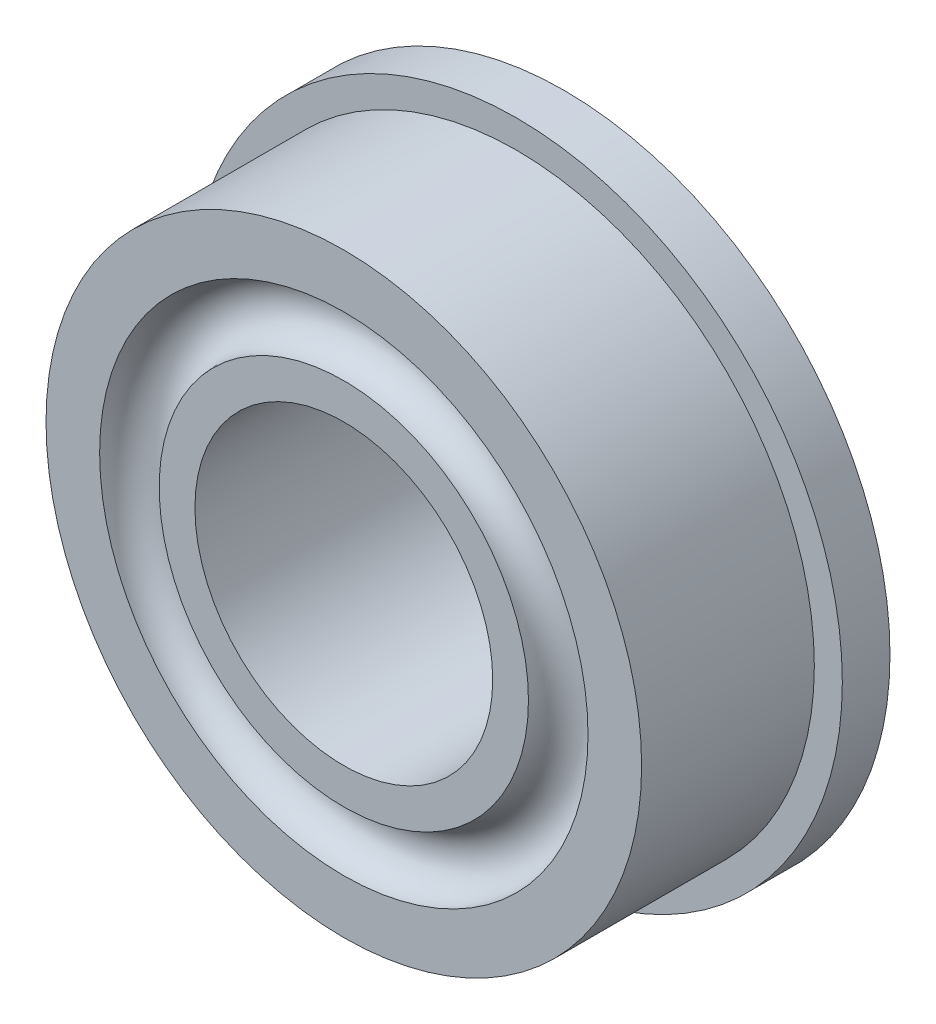
ISO-10303-21;
HEADER;
FILE_DESCRIPTION(('STEP AP214'),'2;1');
FILE_NAME('part.step','',(''),(''),'','','');
FILE_SCHEMA(('AUTOMOTIVE_DESIGN { 1 0 10303 214 1 1 1 1 }'));
ENDSEC;
DATA;
#1=APPLICATION_CONTEXT('core data for automotive mechanical design processes');
#2=APPLICATION_PROTOCOL_DEFINITION('international standard','automotive_design',2000,#1);
#3=PRODUCT_CONTEXT('',#1,'mechanical');
#4=PRODUCT('Part','Part','',(#3));
#5=PRODUCT_RELATED_PRODUCT_CATEGORY('part','',(#4));
#6=PRODUCT_DEFINITION_FORMATION('','',#4);
#7=PRODUCT_DEFINITION_CONTEXT('part definition',#1,'design');
#8=PRODUCT_DEFINITION('design','',#6,#7);
#9=PRODUCT_DEFINITION_SHAPE('','',#8);
#10=(LENGTH_UNIT() NAMED_UNIT(*) SI_UNIT(.MILLI.,.METRE.));
#11=(NAMED_UNIT(*) PLANE_ANGLE_UNIT() SI_UNIT($,.RADIAN.));
#12=(NAMED_UNIT(*) SI_UNIT($,.STERADIAN.) SOLID_ANGLE_UNIT());
#13=UNCERTAINTY_MEASURE_WITH_UNIT(LENGTH_MEASURE(1.E-05),#10,'distance_accuracy_value','');
#14=(GEOMETRIC_REPRESENTATION_CONTEXT(3) GLOBAL_UNCERTAINTY_ASSIGNED_CONTEXT((#13)) GLOBAL_UNIT_ASSIGNED_CONTEXT((#10,
#11,#12)) REPRESENTATION_CONTEXT('',''));
#15=CARTESIAN_POINT('',(0.,0.,0.));
#16=DIRECTION('',(0.,0.,1.));
#17=DIRECTION('',(1.,0.,0.));
#18=AXIS2_PLACEMENT_3D('',#15,#16,#17);
#19=CARTESIAN_POINT('',(0.,0.,0.));
#20=DIRECTION('',(0.,0.,1.));
#21=DIRECTION('',(1.,0.,0.));
#22=AXIS2_PLACEMENT_3D('',#19,#20,#21);
#23=PLANE('',#22);
#24=CARTESIAN_POINT('',(0.,0.,0.));
#25=DIRECTION('',(0.,0.,1.));
#26=DIRECTION('',(1.,0.,0.));
#27=AXIS2_PLACEMENT_3D('',#24,#25,#26);
#28=CIRCLE('',#27,6.9469);
#29=CARTESIAN_POINT('',(6.9469,0.,0.));
#30=VERTEX_POINT('',#29);
#31=EDGE_CURVE('E37',#30,#30,#28,.T.);
#32=ORIENTED_EDGE('',*,*,#31,.F.);
#33=EDGE_LOOP('',(#32));
#34=FACE_BOUND('',#33,.T.);
#35=CARTESIAN_POINT('',(0.,0.,0.));
#36=DIRECTION('',(0.,0.,1.));
#37=DIRECTION('',(1.,0.,0.));
#38=AXIS2_PLACEMENT_3D('',#35,#36,#37);
#39=CIRCLE('',#38,5.207);
#40=CARTESIAN_POINT('',(5.207,0.,0.));
#41=VERTEX_POINT('',#40);
#42=EDGE_CURVE('E66',#41,#41,#39,.T.);
#43=ORIENTED_EDGE('',*,*,#42,.T.);
#44=EDGE_LOOP('',(#43));
#45=FACE_BOUND('',#44,.T.);
#46=ADVANCED_FACE('F33',(#34,#45),#23,.F.);
#47=CARTESIAN_POINT('',(0.,0.,0.));
#48=DIRECTION('',(0.,0.,1.));
#49=DIRECTION('',(1.,0.,0.));
#50=AXIS2_PLACEMENT_3D('',#47,#48,#49);
#51=CIRCLE('',#50,3.175);
#52=CARTESIAN_POINT('',(3.175,0.,0.));
#53=VERTEX_POINT('',#52);
#54=EDGE_CURVE('E44',#53,#53,#51,.T.);
#55=ORIENTED_EDGE('',*,*,#54,.T.);
#56=EDGE_LOOP('',(#55));
#57=FACE_BOUND('',#56,.T.);
#58=CARTESIAN_POINT('',(0.,0.,0.));
#59=DIRECTION('',(0.,0.,1.));
#60=DIRECTION('',(1.,0.,0.));
#61=AXIS2_PLACEMENT_3D('',#58,#59,#60);
#62=CIRCLE('',#61,3.937);
#63=CARTESIAN_POINT('',(3.937,0.,0.));
#64=VERTEX_POINT('',#63);
#65=EDGE_CURVE('E63',#64,#64,#62,.T.);
#66=ORIENTED_EDGE('',*,*,#65,.F.);
#67=EDGE_LOOP('',(#66));
#68=FACE_BOUND('',#67,.T.);
#69=ADVANCED_FACE('F83',(#57,#68),#23,.F.);
#70=CARTESIAN_POINT('',(0.,0.,4.699));
#71=DIRECTION('',(0.,0.,1.));
#72=DIRECTION('',(1.,0.,0.));
#73=AXIS2_PLACEMENT_3D('',#70,#71,#72);
#74=PLANE('',#73);
#75=CARTESIAN_POINT('',(0.,0.,4.699));
#76=DIRECTION('',(0.,0.,1.));
#77=DIRECTION('',(1.,0.,0.));
#78=AXIS2_PLACEMENT_3D('',#75,#76,#77);
#79=CIRCLE('',#78,6.35);
#80=CARTESIAN_POINT('',(6.35,0.,4.699));
#81=VERTEX_POINT('',#80);
#82=EDGE_CURVE('E48',#81,#81,#79,.T.);
#83=ORIENTED_EDGE('',*,*,#82,.T.);
#84=EDGE_LOOP('',(#83));
#85=FACE_BOUND('',#84,.T.);
#86=CARTESIAN_POINT('',(0.,0.,4.699));
#87=DIRECTION('',(0.,0.,1.));
#88=DIRECTION('',(1.,0.,0.));
#89=AXIS2_PLACEMENT_3D('',#86,#87,#88);
#90=CIRCLE('',#89,5.207);
#91=CARTESIAN_POINT('',(5.207,0.,4.699));
#92=VERTEX_POINT('',#91);
#93=EDGE_CURVE('E60',#92,#92,#90,.T.);
#94=ORIENTED_EDGE('',*,*,#93,.F.);
#95=EDGE_LOOP('',(#94));
#96=FACE_BOUND('',#95,.T.);
#97=ADVANCED_FACE('F88',(#85,#96),#74,.T.);
#98=CARTESIAN_POINT('',(0.,0.,4.699));
#99=DIRECTION('',(0.,0.,1.));
#100=DIRECTION('',(1.,0.,0.));
#101=AXIS2_PLACEMENT_3D('',#98,#99,#100);
#102=CIRCLE('',#101,3.175);
#103=CARTESIAN_POINT('',(3.175,0.,4.699));
#104=VERTEX_POINT('',#103);
#105=EDGE_CURVE('E52',#104,#104,#102,.T.);
#106=ORIENTED_EDGE('',*,*,#105,.F.);
#107=EDGE_LOOP('',(#106));
#108=FACE_BOUND('',#107,.T.);
#109=CARTESIAN_POINT('',(0.,0.,4.699));
#110=DIRECTION('',(0.,0.,1.));
#111=DIRECTION('',(1.,0.,0.));
#112=AXIS2_PLACEMENT_3D('',#109,#110,#111);
#113=CIRCLE('',#112,3.937);
#114=CARTESIAN_POINT('',(3.937,0.,4.699));
#115=VERTEX_POINT('',#114);
#116=EDGE_CURVE('E57',#115,#115,#113,.T.);
#117=ORIENTED_EDGE('',*,*,#116,.T.);
#118=EDGE_LOOP('',(#117));
#119=FACE_BOUND('',#118,.T.);
#120=ADVANCED_FACE('F95',(#108,#119),#74,.T.);
#121=CARTESIAN_POINT('',(0.,0.,1.016));
#122=DIRECTION('',(0.,0.,1.));
#123=DIRECTION('',(1.,0.,0.));
#124=AXIS2_PLACEMENT_3D('',#121,#122,#123);
#125=PLANE('',#124);
#126=CARTESIAN_POINT('',(0.,0.,1.016));
#127=DIRECTION('',(0.,0.,1.));
#128=DIRECTION('',(1.,0.,0.));
#129=AXIS2_PLACEMENT_3D('',#126,#127,#128);
#130=CIRCLE('',#129,6.9469);
#131=CARTESIAN_POINT('',(6.9469,0.,1.016));
#132=VERTEX_POINT('',#131);
#133=EDGE_CURVE('E10',#132,#132,#130,.T.);
#134=ORIENTED_EDGE('',*,*,#133,.T.);
#135=EDGE_LOOP('',(#134));
#136=FACE_BOUND('',#135,.T.);
#137=CARTESIAN_POINT('',(0.,0.,1.016));
#138=DIRECTION('',(0.,0.,1.));
#139=DIRECTION('',(1.,0.,0.));
#140=AXIS2_PLACEMENT_3D('',#137,#138,#139);
#141=CIRCLE('',#140,6.35);
#142=CARTESIAN_POINT('',(6.35,0.,1.016));
#143=VERTEX_POINT('',#142);
#144=EDGE_CURVE('E49',#143,#143,#141,.T.);
#145=ORIENTED_EDGE('',*,*,#144,.F.);
#146=EDGE_LOOP('',(#145));
#147=FACE_BOUND('',#146,.T.);
#148=ADVANCED_FACE('F92',(#136,#147),#125,.T.);
#149=CARTESIAN_POINT('',(0.,0.,1.016));
#150=DIRECTION('',(0.,0.,-1.));
#151=DIRECTION('',(-1.,0.,0.));
#152=AXIS2_PLACEMENT_3D('',#149,#150,#151);
#153=CYLINDRICAL_SURFACE('',#152,6.9469);
#154=ORIENTED_EDGE('',*,*,#133,.F.);
#155=EDGE_LOOP('',(#154));
#156=FACE_BOUND('',#155,.T.);
#157=ORIENTED_EDGE('',*,*,#31,.T.);
#158=EDGE_LOOP('',(#157));
#159=FACE_BOUND('',#158,.T.);
#160=ADVANCED_FACE('F35',(#156,#159),#153,.T.);
#161=CARTESIAN_POINT('',(0.,0.,1.016));
#162=DIRECTION('',(0.,0.,-1.));
#163=DIRECTION('',(-1.,0.,0.));
#164=AXIS2_PLACEMENT_3D('',#161,#162,#163);
#165=CYLINDRICAL_SURFACE('',#164,3.175);
#166=ORIENTED_EDGE('',*,*,#54,.F.);
#167=EDGE_LOOP('',(#166));
#168=FACE_BOUND('',#167,.T.);
#169=ORIENTED_EDGE('',*,*,#105,.T.);
#170=EDGE_LOOP('',(#169));
#171=FACE_BOUND('',#170,.T.);
#172=ADVANCED_FACE('F96',(#168,#171),#165,.F.);
#173=CARTESIAN_POINT('',(0.,0.,4.699));
#174=DIRECTION('',(0.,0.,-1.));
#175=DIRECTION('',(-1.,0.,0.));
#176=AXIS2_PLACEMENT_3D('',#173,#174,#175);
#177=CYLINDRICAL_SURFACE('',#176,6.35);
#178=ORIENTED_EDGE('',*,*,#82,.F.);
#179=EDGE_LOOP('',(#178));
#180=FACE_BOUND('',#179,.T.);
#181=ORIENTED_EDGE('',*,*,#144,.T.);
#182=EDGE_LOOP('',(#181));
#183=FACE_BOUND('',#182,.T.);
#184=ADVANCED_FACE('F79',(#180,#183),#177,.T.);
#185=CARTESIAN_POINT('',(0.,0.,4.699));
#186=DIRECTION('',(0.,0.,1.));
#187=DIRECTION('',(1.,0.,0.));
#188=AXIS2_PLACEMENT_3D('',#185,#186,#187);
#189=TOROIDAL_SURFACE('',#188,4.572,0.635);
#190=ORIENTED_EDGE('',*,*,#93,.T.);
#191=EDGE_LOOP('',(#190));
#192=FACE_BOUND('',#191,.T.);
#193=ORIENTED_EDGE('',*,*,#116,.F.);
#194=EDGE_LOOP('',(#193));
#195=FACE_BOUND('',#194,.T.);
#196=ADVANCED_FACE('F73',(#192,#195),#189,.F.);
#197=CARTESIAN_POINT('',(0.,0.,0.));
#198=DIRECTION('',(0.,0.,1.));
#199=DIRECTION('',(1.,0.,0.));
#200=AXIS2_PLACEMENT_3D('',#197,#198,#199);
#201=TOROIDAL_SURFACE('',#200,4.572,0.635);
#202=ORIENTED_EDGE('',*,*,#65,.T.);
#203=EDGE_LOOP('',(#202));
#204=FACE_BOUND('',#203,.T.);
#205=ORIENTED_EDGE('',*,*,#42,.F.);
#206=EDGE_LOOP('',(#205));
#207=FACE_BOUND('',#206,.T.);
#208=ADVANCED_FACE('F71',(#204,#207),#201,.F.);
#209=CLOSED_SHELL('',(#46,#69,#97,#120,#148,#160,#172,#184,#196,#208));
#210=MANIFOLD_SOLID_BREP('B2',#209);
#211=ADVANCED_BREP_SHAPE_REPRESENTATION('',(#18,#210),#14);
#212=SHAPE_DEFINITION_REPRESENTATION(#9,#211);
ENDSEC;
END-ISO-10303-21;
